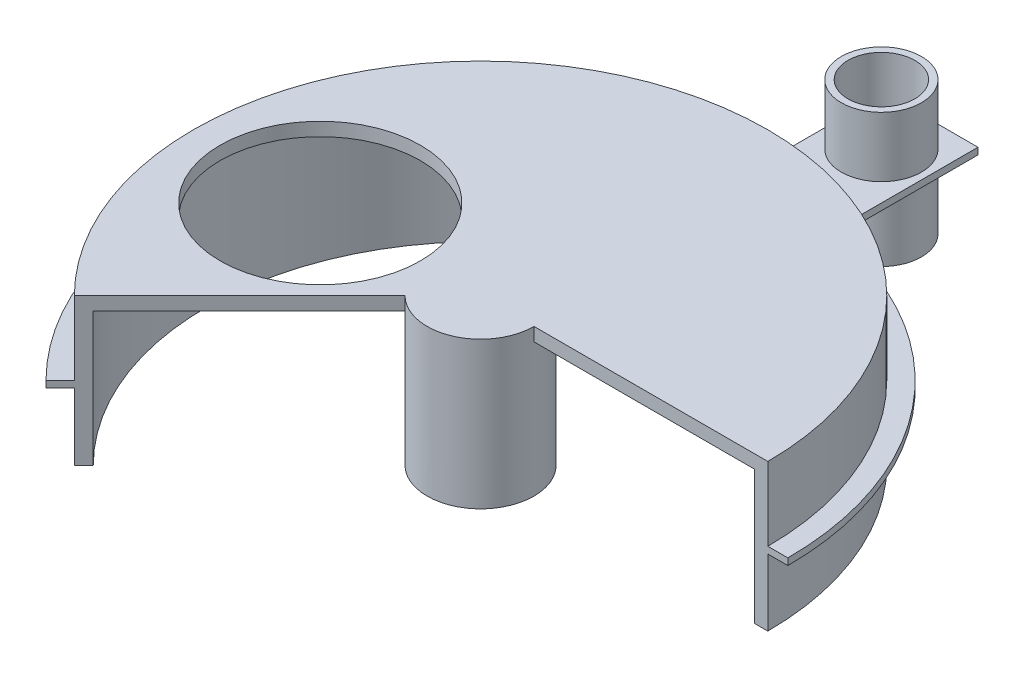
ISO-10303-21;
HEADER;
FILE_DESCRIPTION(('STEP AP214'),'2;1');
FILE_NAME('part.step','',(''),(''),'','','');
FILE_SCHEMA(('AUTOMOTIVE_DESIGN { 1 0 10303 214 1 1 1 1 }'));
ENDSEC;
DATA;
#1=APPLICATION_CONTEXT('core data for automotive mechanical design processes');
#2=APPLICATION_PROTOCOL_DEFINITION('international standard','automotive_design',2000,#1);
#3=PRODUCT_CONTEXT('',#1,'mechanical');
#4=PRODUCT('Part','Part','',(#3));
#5=PRODUCT_RELATED_PRODUCT_CATEGORY('part','',(#4));
#6=PRODUCT_DEFINITION_FORMATION('','',#4);
#7=PRODUCT_DEFINITION_CONTEXT('part definition',#1,'design');
#8=PRODUCT_DEFINITION('design','',#6,#7);
#9=PRODUCT_DEFINITION_SHAPE('','',#8);
#10=(LENGTH_UNIT() NAMED_UNIT(*) SI_UNIT(.MILLI.,.METRE.));
#11=(NAMED_UNIT(*) PLANE_ANGLE_UNIT() SI_UNIT($,.RADIAN.));
#12=(NAMED_UNIT(*) SI_UNIT($,.STERADIAN.) SOLID_ANGLE_UNIT());
#13=UNCERTAINTY_MEASURE_WITH_UNIT(LENGTH_MEASURE(1.E-05),#10,'distance_accuracy_value','');
#14=(GEOMETRIC_REPRESENTATION_CONTEXT(3) GLOBAL_UNCERTAINTY_ASSIGNED_CONTEXT((#13)) GLOBAL_UNIT_ASSIGNED_CONTEXT((#10,
#11,#12)) REPRESENTATION_CONTEXT('',''));
#15=CARTESIAN_POINT('',(0.,0.,0.));
#16=DIRECTION('',(0.,0.,1.));
#17=DIRECTION('',(1.,0.,0.));
#18=AXIS2_PLACEMENT_3D('',#15,#16,#17);
#19=CARTESIAN_POINT('',(0.,100.,-300.));
#20=DIRECTION('',(0.,1.,0.));
#21=DIRECTION('',(0.,0.,1.));
#22=AXIS2_PLACEMENT_3D('',#19,#20,#21);
#23=PLANE('',#22);
#24=CARTESIAN_POINT('',(0.,100.,-300.));
#25=DIRECTION('',(0.,1.,0.));
#26=DIRECTION('',(0.,0.,1.));
#27=AXIS2_PLACEMENT_3D('',#24,#25,#26);
#28=CIRCLE('',#27,30.);
#29=CARTESIAN_POINT('',(0.,100.,-270.));
#30=VERTEX_POINT('',#29);
#31=EDGE_CURVE('E107',#30,#30,#28,.T.);
#32=ORIENTED_EDGE('',*,*,#31,.T.);
#33=EDGE_LOOP('',(#32));
#34=FACE_BOUND('',#33,.T.);
#35=CARTESIAN_POINT('',(0.,100.,-300.));
#36=DIRECTION('',(0.,1.,0.));
#37=DIRECTION('',(0.,0.,1.));
#38=AXIS2_PLACEMENT_3D('',#35,#36,#37);
#39=CIRCLE('',#38,25.);
#40=CARTESIAN_POINT('',(0.,100.,-275.));
#41=VERTEX_POINT('',#40);
#42=EDGE_CURVE('E98',#41,#41,#39,.T.);
#43=ORIENTED_EDGE('',*,*,#42,.F.);
#44=EDGE_LOOP('',(#43));
#45=FACE_BOUND('',#44,.T.);
#46=ADVANCED_FACE('F94',(#34,#45),#23,.T.);
#47=CARTESIAN_POINT('',(0.,0.,-300.));
#48=DIRECTION('',(0.,1.,0.));
#49=DIRECTION('',(0.,0.,1.));
#50=AXIS2_PLACEMENT_3D('',#47,#48,#49);
#51=PLANE('',#50);
#52=CARTESIAN_POINT('',(0.,0.,-300.));
#53=DIRECTION('',(0.,1.,0.));
#54=DIRECTION('',(0.,0.,1.));
#55=AXIS2_PLACEMENT_3D('',#52,#53,#54);
#56=CIRCLE('',#55,30.);
#57=CARTESIAN_POINT('',(0.,0.,-270.));
#58=VERTEX_POINT('',#57);
#59=EDGE_CURVE('E105',#58,#58,#56,.T.);
#60=ORIENTED_EDGE('',*,*,#59,.F.);
#61=EDGE_LOOP('',(#60));
#62=FACE_BOUND('',#61,.T.);
#63=CARTESIAN_POINT('',(0.,0.,-300.));
#64=DIRECTION('',(0.,1.,0.));
#65=DIRECTION('',(0.,0.,1.));
#66=AXIS2_PLACEMENT_3D('',#63,#64,#65);
#67=CIRCLE('',#66,25.);
#68=CARTESIAN_POINT('',(0.,0.,-275.));
#69=VERTEX_POINT('',#68);
#70=EDGE_CURVE('E12',#69,#69,#67,.T.);
#71=ORIENTED_EDGE('',*,*,#70,.T.);
#72=EDGE_LOOP('',(#71));
#73=FACE_BOUND('',#72,.T.);
#74=ADVANCED_FACE('F115',(#62,#73),#51,.F.);
#75=CARTESIAN_POINT('',(0.,100.,-300.));
#76=DIRECTION('',(0.,-1.,0.));
#77=DIRECTION('',(0.,0.,-1.));
#78=AXIS2_PLACEMENT_3D('',#75,#76,#77);
#79=CYLINDRICAL_SURFACE('',#78,30.);
#80=ORIENTED_EDGE('',*,*,#31,.F.);
#81=EDGE_LOOP('',(#80));
#82=FACE_BOUND('',#81,.T.);
#83=ORIENTED_EDGE('',*,*,#59,.T.);
#84=EDGE_LOOP('',(#83));
#85=FACE_BOUND('',#84,.T.);
#86=ADVANCED_FACE('F113',(#82,#85),#79,.T.);
#87=CARTESIAN_POINT('',(0.,100.,-300.));
#88=DIRECTION('',(0.,-1.,0.));
#89=DIRECTION('',(0.,0.,-1.));
#90=AXIS2_PLACEMENT_3D('',#87,#88,#89);
#91=CYLINDRICAL_SURFACE('',#90,25.);
#92=ORIENTED_EDGE('',*,*,#42,.T.);
#93=EDGE_LOOP('',(#92));
#94=FACE_BOUND('',#93,.T.);
#95=ORIENTED_EDGE('',*,*,#70,.F.);
#96=EDGE_LOOP('',(#95));
#97=FACE_BOUND('',#96,.T.);
#98=ADVANCED_FACE('F96',(#94,#97),#91,.F.);
#99=CLOSED_SHELL('',(#46,#74,#86,#98));
#100=MANIFOLD_SOLID_BREP('B2',#99);
#101=CARTESIAN_POINT('',(0.,110.,0.));
#102=DIRECTION('',(0.,0.,-1.));
#103=DIRECTION('',(-1.,0.,0.));
#104=AXIS2_PLACEMENT_3D('',#101,#102,#103);
#105=PLANE('',#104);
#106=DIRECTION('',(0.,-1.,0.));
#107=VECTOR('',#106,1.);
#108=CARTESIAN_POINT('',(40.,110.,0.));
#109=LINE('',#108,#107);
#110=CARTESIAN_POINT('',(40.,110.,0.));
#111=VERTEX_POINT('',#110);
#112=CARTESIAN_POINT('',(40.,100.,0.));
#113=VERTEX_POINT('',#112);
#114=EDGE_CURVE('E271',#111,#113,#109,.T.);
#115=ORIENTED_EDGE('',*,*,#114,.T.);
#116=DIRECTION('',(1.,0.,0.));
#117=VECTOR('',#116,1.);
#118=CARTESIAN_POINT('',(0.,100.,0.));
#119=LINE('',#118,#117);
#120=CARTESIAN_POINT('',(205.,100.,0.));
#121=VERTEX_POINT('',#120);
#122=EDGE_CURVE('E297',#113,#121,#119,.T.);
#123=ORIENTED_EDGE('',*,*,#122,.T.);
#124=DIRECTION('',(0.,-1.,0.));
#125=VECTOR('',#124,1.);
#126=CARTESIAN_POINT('',(205.,100.,0.));
#127=LINE('',#126,#125);
#128=CARTESIAN_POINT('',(205.,0.,0.));
#129=VERTEX_POINT('',#128);
#130=EDGE_CURVE('E427',#121,#129,#127,.T.);
#131=ORIENTED_EDGE('',*,*,#130,.T.);
#132=DIRECTION('',(1.,0.,0.));
#133=VECTOR('',#132,1.);
#134=CARTESIAN_POINT('',(215.,0.,0.));
#135=LINE('',#134,#133);
#136=CARTESIAN_POINT('',(215.,0.,0.));
#137=VERTEX_POINT('',#136);
#138=EDGE_CURVE('E431',#129,#137,#135,.T.);
#139=ORIENTED_EDGE('',*,*,#138,.T.);
#140=DIRECTION('',(0.,-1.,0.));
#141=VECTOR('',#140,1.);
#142=CARTESIAN_POINT('',(215.,110.,0.));
#143=LINE('',#142,#141);
#144=CARTESIAN_POINT('',(215.,50.,0.));
#145=VERTEX_POINT('',#144);
#146=EDGE_CURVE('E304',#145,#137,#143,.T.);
#147=ORIENTED_EDGE('',*,*,#146,.F.);
#148=DIRECTION('',(1.,0.,0.));
#149=VECTOR('',#148,1.);
#150=CARTESIAN_POINT('',(0.,50.,0.));
#151=LINE('',#150,#149);
#152=CARTESIAN_POINT('',(230.,50.,0.));
#153=VERTEX_POINT('',#152);
#154=EDGE_CURVE('E393',#145,#153,#151,.T.);
#155=ORIENTED_EDGE('',*,*,#154,.T.);
#156=DIRECTION('',(0.,-1.,0.));
#157=VECTOR('',#156,1.);
#158=CARTESIAN_POINT('',(230.,55.,0.));
#159=LINE('',#158,#157);
#160=CARTESIAN_POINT('',(230.,55.,0.));
#161=VERTEX_POINT('',#160);
#162=EDGE_CURVE('E391',#161,#153,#159,.T.);
#163=ORIENTED_EDGE('',*,*,#162,.F.);
#164=DIRECTION('',(1.,0.,0.));
#165=VECTOR('',#164,1.);
#166=CARTESIAN_POINT('',(0.,55.,0.));
#167=LINE('',#166,#165);
#168=CARTESIAN_POINT('',(215.,55.,0.));
#169=VERTEX_POINT('',#168);
#170=EDGE_CURVE('E382',#169,#161,#167,.T.);
#171=ORIENTED_EDGE('',*,*,#170,.F.);
#172=CARTESIAN_POINT('',(215.,110.,0.));
#173=VERTEX_POINT('',#172);
#174=EDGE_CURVE('E280',#173,#169,#143,.T.);
#175=ORIENTED_EDGE('',*,*,#174,.F.);
#176=DIRECTION('',(1.,0.,0.));
#177=VECTOR('',#176,1.);
#178=CARTESIAN_POINT('',(0.,110.,0.));
#179=LINE('',#178,#177);
#180=EDGE_CURVE('E262',#111,#173,#179,.T.);
#181=ORIENTED_EDGE('',*,*,#180,.F.);
#182=EDGE_LOOP('',(#115,#123,#131,#139,#147,#155,#163,#171,#175,#181));
#183=FACE_BOUND('',#182,.T.);
#184=ADVANCED_FACE('F155',(#183),#105,.F.);
#185=CARTESIAN_POINT('',(5.88784672006415E-13,110.,5.88784672006417E-13));
#186=DIRECTION('',(-0.707106781186546,0.,-0.707106781186549));
#187=DIRECTION('',(-0.707106781186549,0.,0.707106781186546));
#188=AXIS2_PLACEMENT_3D('',#185,#186,#187);
#189=PLANE('',#188);
#190=DIRECTION('',(0.,-1.,0.));
#191=VECTOR('',#190,1.);
#192=CARTESIAN_POINT('',(-28.2842712474614,110.,28.2842712474624));
#193=LINE('',#192,#191);
#194=CARTESIAN_POINT('',(-28.2842712474614,110.,28.2842712474624));
#195=VERTEX_POINT('',#194);
#196=CARTESIAN_POINT('',(-28.2842712474614,100.,28.2842712474624));
#197=VERTEX_POINT('',#196);
#198=EDGE_CURVE('E268',#195,#197,#193,.T.);
#199=ORIENTED_EDGE('',*,*,#198,.F.);
#200=DIRECTION('',(0.707106781186549,0.,-0.707106781186546));
#201=VECTOR('',#200,1.);
#202=CARTESIAN_POINT('',(5.88784672006415E-13,110.,5.88784672006417E-13));
#203=LINE('',#202,#201);
#204=CARTESIAN_POINT('',(-152.027957955107,110.,152.027957955108));
#205=VERTEX_POINT('',#204);
#206=EDGE_CURVE('E265',#205,#195,#203,.T.);
#207=ORIENTED_EDGE('',*,*,#206,.F.);
#208=DIRECTION('',(0.,-1.,0.));
#209=VECTOR('',#208,1.);
#210=CARTESIAN_POINT('',(-152.027957955107,110.,152.027957955108));
#211=LINE('',#210,#209);
#212=CARTESIAN_POINT('',(-152.027957955107,55.,152.027957955108));
#213=VERTEX_POINT('',#212);
#214=EDGE_CURVE('E301',#205,#213,#211,.T.);
#215=ORIENTED_EDGE('',*,*,#214,.T.);
#216=DIRECTION('',(-0.707106781186546,0.,0.707106781186549));
#217=VECTOR('',#216,1.);
#218=CARTESIAN_POINT('',(0.,55.,0.));
#219=LINE('',#218,#217);
#220=CARTESIAN_POINT('',(-162.634559672906,55.,162.634559672906));
#221=VERTEX_POINT('',#220);
#222=EDGE_CURVE('E473',#213,#221,#219,.T.);
#223=ORIENTED_EDGE('',*,*,#222,.T.);
#224=DIRECTION('',(0.,-1.,0.));
#225=VECTOR('',#224,1.);
#226=CARTESIAN_POINT('',(-162.634559672906,55.,162.634559672906));
#227=LINE('',#226,#225);
#228=CARTESIAN_POINT('',(-162.634559672906,50.,162.634559672906));
#229=VERTEX_POINT('',#228);
#230=EDGE_CURVE('E460',#221,#229,#227,.T.);
#231=ORIENTED_EDGE('',*,*,#230,.T.);
#232=DIRECTION('',(-0.707106781186546,0.,0.707106781186549));
#233=VECTOR('',#232,1.);
#234=CARTESIAN_POINT('',(0.,50.,0.));
#235=LINE('',#234,#233);
#236=CARTESIAN_POINT('',(-152.027957955107,50.,152.027957955108));
#237=VERTEX_POINT('',#236);
#238=EDGE_CURVE('E453',#237,#229,#235,.T.);
#239=ORIENTED_EDGE('',*,*,#238,.F.);
#240=CARTESIAN_POINT('',(-152.027957955107,0.,152.027957955108));
#241=VERTEX_POINT('',#240);
#242=EDGE_CURVE('E296',#237,#241,#211,.T.);
#243=ORIENTED_EDGE('',*,*,#242,.T.);
#244=DIRECTION('',(0.707106781186549,0.,-0.707106781186546));
#245=VECTOR('',#244,1.);
#246=CARTESIAN_POINT('',(-144.956890143242,0.,144.956890143243));
#247=LINE('',#246,#245);
#248=CARTESIAN_POINT('',(-144.956890143242,0.,144.956890143243));
#249=VERTEX_POINT('',#248);
#250=EDGE_CURVE('E396',#241,#249,#247,.T.);
#251=ORIENTED_EDGE('',*,*,#250,.T.);
#252=DIRECTION('',(0.,-1.,0.));
#253=VECTOR('',#252,1.);
#254=CARTESIAN_POINT('',(-144.956890143242,100.,144.956890143243));
#255=LINE('',#254,#253);
#256=CARTESIAN_POINT('',(-144.956890143242,100.,144.956890143243));
#257=VERTEX_POINT('',#256);
#258=EDGE_CURVE('E289',#257,#249,#255,.T.);
#259=ORIENTED_EDGE('',*,*,#258,.F.);
#260=DIRECTION('',(0.707106781186549,0.,-0.707106781186546));
#261=VECTOR('',#260,1.);
#262=CARTESIAN_POINT('',(5.88784672006415E-13,100.,5.88784672006417E-13));
#263=LINE('',#262,#261);
#264=EDGE_CURVE('E286',#257,#197,#263,.T.);
#265=ORIENTED_EDGE('',*,*,#264,.T.);
#266=EDGE_LOOP('',(#199,#207,#215,#223,#231,#239,#243,#251,#259,#265));
#267=FACE_BOUND('',#266,.T.);
#268=ADVANCED_FACE('F334',(#267),#189,.F.);
#269=CARTESIAN_POINT('',(0.,110.,0.));
#270=DIRECTION('',(0.,-1.,0.));
#271=DIRECTION('',(0.,0.,-1.));
#272=AXIS2_PLACEMENT_3D('',#269,#270,#271);
#273=CYLINDRICAL_SURFACE('',#272,215.);
#274=CARTESIAN_POINT('',(0.,50.,0.));
#275=DIRECTION('',(0.,1.,0.));
#276=DIRECTION('',(0.,0.,1.));
#277=AXIS2_PLACEMENT_3D('',#274,#275,#276);
#278=CIRCLE('',#277,215.);
#279=EDGE_CURVE('E170',#145,#237,#278,.T.);
#280=ORIENTED_EDGE('',*,*,#279,.F.);
#281=ORIENTED_EDGE('',*,*,#146,.T.);
#282=CARTESIAN_POINT('',(0.,0.,0.));
#283=DIRECTION('',(0.,1.,0.));
#284=DIRECTION('',(0.,0.,-1.));
#285=AXIS2_PLACEMENT_3D('',#282,#283,#284);
#286=CIRCLE('',#285,215.);
#287=EDGE_CURVE('E428',#137,#241,#286,.T.);
#288=ORIENTED_EDGE('',*,*,#287,.T.);
#289=ORIENTED_EDGE('',*,*,#242,.F.);
#290=EDGE_LOOP('',(#280,#281,#288,#289));
#291=FACE_BOUND('',#290,.T.);
#292=ADVANCED_FACE('F339',(#291),#273,.T.);
#293=CARTESIAN_POINT('',(0.,100.,0.));
#294=DIRECTION('',(0.,1.,0.));
#295=DIRECTION('',(0.,0.,1.));
#296=AXIS2_PLACEMENT_3D('',#293,#294,#295);
#297=PLANE('',#296);
#298=CARTESIAN_POINT('',(-120.,100.,0.));
#299=DIRECTION('',(0.,1.,0.));
#300=DIRECTION('',(0.,0.,1.));
#301=AXIS2_PLACEMENT_3D('',#298,#299,#300);
#302=CIRCLE('',#301,75.);
#303=CARTESIAN_POINT('',(-120.,100.,75.));
#304=VERTEX_POINT('',#303);
#305=EDGE_CURVE('E282',#304,#304,#302,.T.);
#306=ORIENTED_EDGE('',*,*,#305,.T.);
#307=EDGE_LOOP('',(#306));
#308=FACE_BOUND('',#307,.T.);
#309=CARTESIAN_POINT('',(0.,100.,0.));
#310=DIRECTION('',(0.,-1.,0.));
#311=DIRECTION('',(0.,0.,1.));
#312=AXIS2_PLACEMENT_3D('',#309,#310,#311);
#313=CIRCLE('',#312,205.);
#314=EDGE_CURVE('E178',#257,#121,#313,.T.);
#315=ORIENTED_EDGE('',*,*,#314,.T.);
#316=ORIENTED_EDGE('',*,*,#122,.F.);
#317=CARTESIAN_POINT('',(0.,100.,0.));
#318=DIRECTION('',(0.,1.,0.));
#319=DIRECTION('',(0.,0.,1.));
#320=AXIS2_PLACEMENT_3D('',#317,#318,#319);
#321=CIRCLE('',#320,40.);
#322=EDGE_CURVE('E92',#113,#197,#321,.T.);
#323=ORIENTED_EDGE('',*,*,#322,.T.);
#324=ORIENTED_EDGE('',*,*,#264,.F.);
#325=EDGE_LOOP('',(#315,#316,#323,#324));
#326=FACE_BOUND('',#325,.T.);
#327=ADVANCED_FACE('F332',(#308,#326),#297,.F.);
#328=CARTESIAN_POINT('',(0.,0.,0.));
#329=DIRECTION('',(0.,1.,0.));
#330=DIRECTION('',(0.,0.,1.));
#331=AXIS2_PLACEMENT_3D('',#328,#329,#330);
#332=PLANE('',#331);
#333=CARTESIAN_POINT('',(0.,0.,0.));
#334=DIRECTION('',(0.,1.,0.));
#335=DIRECTION('',(0.,0.,1.));
#336=AXIS2_PLACEMENT_3D('',#333,#334,#335);
#337=CIRCLE('',#336,40.);
#338=CARTESIAN_POINT('',(0.,0.,40.));
#339=VERTEX_POINT('',#338);
#340=EDGE_CURVE('E159',#339,#339,#337,.T.);
#341=ORIENTED_EDGE('',*,*,#340,.F.);
#342=EDGE_LOOP('',(#341));
#343=FACE_BOUND('',#342,.T.);
#344=CARTESIAN_POINT('',(0.,0.,0.));
#345=DIRECTION('',(0.,1.,0.));
#346=DIRECTION('',(0.,0.,1.));
#347=AXIS2_PLACEMENT_3D('',#344,#345,#346);
#348=CIRCLE('',#347,35.);
#349=CARTESIAN_POINT('',(0.,0.,35.));
#350=VERTEX_POINT('',#349);
#351=EDGE_CURVE('E306',#350,#350,#348,.T.);
#352=ORIENTED_EDGE('',*,*,#351,.T.);
#353=EDGE_LOOP('',(#352));
#354=FACE_BOUND('',#353,.T.);
#355=ADVANCED_FACE('F313',(#343,#354),#332,.F.);
#356=CARTESIAN_POINT('',(0.,100.,0.));
#357=DIRECTION('',(0.,-1.,0.));
#358=DIRECTION('',(0.,0.,-1.));
#359=AXIS2_PLACEMENT_3D('',#356,#357,#358);
#360=CYLINDRICAL_SURFACE('',#359,40.);
#361=ORIENTED_EDGE('',*,*,#322,.F.);
#362=ORIENTED_EDGE('',*,*,#114,.F.);
#363=CARTESIAN_POINT('',(0.,110.,0.));
#364=DIRECTION('',(0.,1.,0.));
#365=DIRECTION('',(0.,0.,1.));
#366=AXIS2_PLACEMENT_3D('',#363,#364,#365);
#367=CIRCLE('',#366,40.);
#368=EDGE_CURVE('E257',#195,#111,#367,.T.);
#369=ORIENTED_EDGE('',*,*,#368,.F.);
#370=ORIENTED_EDGE('',*,*,#198,.T.);
#371=EDGE_LOOP('',(#361,#362,#369,#370));
#372=FACE_BOUND('',#371,.T.);
#373=ORIENTED_EDGE('',*,*,#340,.T.);
#374=EDGE_LOOP('',(#373));
#375=FACE_BOUND('',#374,.T.);
#376=ADVANCED_FACE('F157',(#372,#375),#360,.T.);
#377=CARTESIAN_POINT('',(0.,100.,0.));
#378=DIRECTION('',(0.,-1.,0.));
#379=DIRECTION('',(0.,0.,-1.));
#380=AXIS2_PLACEMENT_3D('',#377,#378,#379);
#381=CYLINDRICAL_SURFACE('',#380,35.);
#382=CARTESIAN_POINT('',(0.,100.,0.));
#383=DIRECTION('',(0.,1.,0.));
#384=DIRECTION('',(0.,0.,1.));
#385=AXIS2_PLACEMENT_3D('',#382,#383,#384);
#386=CIRCLE('',#385,35.);
#387=CARTESIAN_POINT('',(0.,100.,35.));
#388=VERTEX_POINT('',#387);
#389=EDGE_CURVE('E307',#388,#388,#386,.T.);
#390=ORIENTED_EDGE('',*,*,#389,.T.);
#391=EDGE_LOOP('',(#390));
#392=FACE_BOUND('',#391,.T.);
#393=ORIENTED_EDGE('',*,*,#351,.F.);
#394=EDGE_LOOP('',(#393));
#395=FACE_BOUND('',#394,.T.);
#396=ADVANCED_FACE('F315',(#392,#395),#381,.F.);
#397=CARTESIAN_POINT('',(-120.,110.,0.));
#398=DIRECTION('',(0.,-1.,0.));
#399=DIRECTION('',(0.,0.,-1.));
#400=AXIS2_PLACEMENT_3D('',#397,#398,#399);
#401=CYLINDRICAL_SURFACE('',#400,75.);
#402=CARTESIAN_POINT('',(-120.,110.,0.));
#403=DIRECTION('',(0.,1.,0.));
#404=DIRECTION('',(0.,0.,1.));
#405=AXIS2_PLACEMENT_3D('',#402,#403,#404);
#406=CIRCLE('',#405,75.);
#407=CARTESIAN_POINT('',(-120.,110.,75.));
#408=VERTEX_POINT('',#407);
#409=EDGE_CURVE('E293',#408,#408,#406,.T.);
#410=ORIENTED_EDGE('',*,*,#409,.T.);
#411=EDGE_LOOP('',(#410));
#412=FACE_BOUND('',#411,.T.);
#413=ORIENTED_EDGE('',*,*,#305,.F.);
#414=EDGE_LOOP('',(#413));
#415=FACE_BOUND('',#414,.T.);
#416=ADVANCED_FACE('F317',(#412,#415),#401,.F.);
#417=ORIENTED_EDGE('',*,*,#389,.F.);
#418=EDGE_LOOP('',(#417));
#419=FACE_BOUND('',#418,.T.);
#420=ADVANCED_FACE('F320',(#419),#297,.F.);
#421=ORIENTED_EDGE('',*,*,#174,.T.);
#422=CARTESIAN_POINT('',(0.,55.,0.));
#423=DIRECTION('',(0.,1.,0.));
#424=DIRECTION('',(0.,0.,1.));
#425=AXIS2_PLACEMENT_3D('',#422,#423,#424);
#426=CIRCLE('',#425,215.);
#427=EDGE_CURVE('E387',#169,#213,#426,.T.);
#428=ORIENTED_EDGE('',*,*,#427,.T.);
#429=ORIENTED_EDGE('',*,*,#214,.F.);
#430=CARTESIAN_POINT('',(0.,110.,0.));
#431=DIRECTION('',(0.,1.,0.));
#432=DIRECTION('',(0.,0.,1.));
#433=AXIS2_PLACEMENT_3D('',#430,#431,#432);
#434=CIRCLE('',#433,215.);
#435=EDGE_CURVE('E281',#173,#205,#434,.T.);
#436=ORIENTED_EDGE('',*,*,#435,.F.);
#437=EDGE_LOOP('',(#421,#428,#429,#436));
#438=FACE_BOUND('',#437,.T.);
#439=ADVANCED_FACE('F328',(#438),#273,.T.);
#440=CARTESIAN_POINT('',(0.,110.,0.));
#441=DIRECTION('',(0.,1.,0.));
#442=DIRECTION('',(0.,0.,1.));
#443=AXIS2_PLACEMENT_3D('',#440,#441,#442);
#444=PLANE('',#443);
#445=ORIENTED_EDGE('',*,*,#368,.T.);
#446=ORIENTED_EDGE('',*,*,#180,.T.);
#447=ORIENTED_EDGE('',*,*,#435,.T.);
#448=ORIENTED_EDGE('',*,*,#206,.T.);
#449=EDGE_LOOP('',(#445,#446,#447,#448));
#450=FACE_BOUND('',#449,.T.);
#451=ORIENTED_EDGE('',*,*,#409,.F.);
#452=EDGE_LOOP('',(#451));
#453=FACE_BOUND('',#452,.T.);
#454=ADVANCED_FACE('F259',(#450,#453),#444,.T.);
#455=CARTESIAN_POINT('',(0.,100.,0.));
#456=DIRECTION('',(0.,-1.,0.));
#457=DIRECTION('',(0.,0.,-1.));
#458=AXIS2_PLACEMENT_3D('',#455,#456,#457);
#459=CYLINDRICAL_SURFACE('',#458,205.);
#460=CARTESIAN_POINT('',(0.,0.,0.));
#461=DIRECTION('',(0.,-1.,0.));
#462=DIRECTION('',(0.,0.,1.));
#463=AXIS2_PLACEMENT_3D('',#460,#461,#462);
#464=CIRCLE('',#463,205.);
#465=EDGE_CURVE('E400',#249,#129,#464,.T.);
#466=ORIENTED_EDGE('',*,*,#465,.T.);
#467=ORIENTED_EDGE('',*,*,#130,.F.);
#468=ORIENTED_EDGE('',*,*,#314,.F.);
#469=ORIENTED_EDGE('',*,*,#258,.T.);
#470=EDGE_LOOP('',(#466,#467,#468,#469));
#471=FACE_BOUND('',#470,.T.);
#472=ADVANCED_FACE('F348',(#471),#459,.F.);
#473=CARTESIAN_POINT('',(0.,0.,0.));
#474=DIRECTION('',(0.,1.,0.));
#475=DIRECTION('',(0.,0.,1.));
#476=AXIS2_PLACEMENT_3D('',#473,#474,#475);
#477=PLANE('',#476);
#478=ORIENTED_EDGE('',*,*,#250,.F.);
#479=ORIENTED_EDGE('',*,*,#287,.F.);
#480=ORIENTED_EDGE('',*,*,#138,.F.);
#481=ORIENTED_EDGE('',*,*,#465,.F.);
#482=EDGE_LOOP('',(#478,#479,#480,#481));
#483=FACE_BOUND('',#482,.T.);
#484=ADVANCED_FACE('F351',(#483),#477,.F.);
#485=CARTESIAN_POINT('',(0.,55.,0.));
#486=DIRECTION('',(0.,-1.,0.));
#487=DIRECTION('',(0.,0.,-1.));
#488=AXIS2_PLACEMENT_3D('',#485,#486,#487);
#489=CYLINDRICAL_SURFACE('',#488,230.);
#490=CARTESIAN_POINT('',(0.,50.,0.));
#491=DIRECTION('',(0.,1.,0.));
#492=DIRECTION('',(0.,0.,1.));
#493=AXIS2_PLACEMENT_3D('',#490,#491,#492);
#494=CIRCLE('',#493,230.);
#495=CARTESIAN_POINT('',(35.,50.,-227.321358433386));
#496=VERTEX_POINT('',#495);
#497=EDGE_CURVE('E469',#153,#496,#494,.T.);
#498=ORIENTED_EDGE('',*,*,#497,.T.);
#499=DIRECTION('',(0.,-1.,0.));
#500=VECTOR('',#499,1.);
#501=CARTESIAN_POINT('',(35.,55.,-227.321358433386));
#502=LINE('',#501,#500);
#503=CARTESIAN_POINT('',(35.,55.,-227.321358433386));
#504=VERTEX_POINT('',#503);
#505=EDGE_CURVE('E397',#504,#496,#502,.T.);
#506=ORIENTED_EDGE('',*,*,#505,.F.);
#507=CARTESIAN_POINT('',(0.,55.,0.));
#508=DIRECTION('',(0.,1.,0.));
#509=DIRECTION('',(0.,0.,1.));
#510=AXIS2_PLACEMENT_3D('',#507,#508,#509);
#511=CIRCLE('',#510,230.);
#512=EDGE_CURVE('E385',#161,#504,#511,.T.);
#513=ORIENTED_EDGE('',*,*,#512,.F.);
#514=ORIENTED_EDGE('',*,*,#162,.T.);
#515=EDGE_LOOP('',(#498,#506,#513,#514));
#516=FACE_BOUND('',#515,.T.);
#517=ADVANCED_FACE('F354',(#516),#489,.T.);
#518=CARTESIAN_POINT('',(-35.,50.,-227.321358433386));
#519=VERTEX_POINT('',#518);
#520=EDGE_CURVE('E456',#519,#229,#494,.T.);
#521=ORIENTED_EDGE('',*,*,#520,.T.);
#522=ORIENTED_EDGE('',*,*,#230,.F.);
#523=CARTESIAN_POINT('',(-35.,55.,-227.321358433386));
#524=VERTEX_POINT('',#523);
#525=EDGE_CURVE('E466',#524,#221,#511,.T.);
#526=ORIENTED_EDGE('',*,*,#525,.F.);
#527=DIRECTION('',(0.,-1.,0.));
#528=VECTOR('',#527,1.);
#529=CARTESIAN_POINT('',(-35.,55.,-227.321358433386));
#530=LINE('',#529,#528);
#531=EDGE_CURVE('E402',#524,#519,#530,.T.);
#532=ORIENTED_EDGE('',*,*,#531,.T.);
#533=EDGE_LOOP('',(#521,#522,#526,#532));
#534=FACE_BOUND('',#533,.T.);
#535=ADVANCED_FACE('F368',(#534),#489,.T.);
#536=CARTESIAN_POINT('',(0.,55.,0.));
#537=DIRECTION('',(0.,1.,0.));
#538=DIRECTION('',(0.,0.,1.));
#539=AXIS2_PLACEMENT_3D('',#536,#537,#538);
#540=PLANE('',#539);
#541=ORIENTED_EDGE('',*,*,#170,.T.);
#542=ORIENTED_EDGE('',*,*,#512,.T.);
#543=DIRECTION('',(0.,0.,1.));
#544=VECTOR('',#543,1.);
#545=CARTESIAN_POINT('',(35.,55.,-337.321358433386));
#546=LINE('',#545,#544);
#547=CARTESIAN_POINT('',(35.,55.,-337.321358433386));
#548=VERTEX_POINT('',#547);
#549=EDGE_CURVE('E413',#548,#504,#546,.T.);
#550=ORIENTED_EDGE('',*,*,#549,.F.);
#551=DIRECTION('',(1.,0.,0.));
#552=VECTOR('',#551,1.);
#553=CARTESIAN_POINT('',(-35.,55.,-337.321358433386));
#554=LINE('',#553,#552);
#555=CARTESIAN_POINT('',(-35.,55.,-337.321358433386));
#556=VERTEX_POINT('',#555);
#557=EDGE_CURVE('E409',#556,#548,#554,.T.);
#558=ORIENTED_EDGE('',*,*,#557,.F.);
#559=DIRECTION('',(0.,0.,-1.));
#560=VECTOR('',#559,1.);
#561=CARTESIAN_POINT('',(-35.,55.,-227.321358433386));
#562=LINE('',#561,#560);
#563=EDGE_CURVE('E406',#524,#556,#562,.T.);
#564=ORIENTED_EDGE('',*,*,#563,.F.);
#565=ORIENTED_EDGE('',*,*,#525,.T.);
#566=ORIENTED_EDGE('',*,*,#222,.F.);
#567=ORIENTED_EDGE('',*,*,#427,.F.);
#568=EDGE_LOOP('',(#541,#542,#550,#558,#564,#565,#566,#567));
#569=FACE_BOUND('',#568,.T.);
#570=ADVANCED_FACE('F371',(#569),#540,.T.);
#571=CARTESIAN_POINT('',(0.,50.,0.));
#572=DIRECTION('',(0.,1.,0.));
#573=DIRECTION('',(0.,0.,1.));
#574=AXIS2_PLACEMENT_3D('',#571,#572,#573);
#575=PLANE('',#574);
#576=ORIENTED_EDGE('',*,*,#154,.F.);
#577=ORIENTED_EDGE('',*,*,#279,.T.);
#578=ORIENTED_EDGE('',*,*,#238,.T.);
#579=ORIENTED_EDGE('',*,*,#520,.F.);
#580=DIRECTION('',(0.,0.,-1.));
#581=VECTOR('',#580,1.);
#582=CARTESIAN_POINT('',(-35.,50.,-227.321358433386));
#583=LINE('',#582,#581);
#584=CARTESIAN_POINT('',(-35.,50.,-337.321358433386));
#585=VERTEX_POINT('',#584);
#586=EDGE_CURVE('E276',#519,#585,#583,.T.);
#587=ORIENTED_EDGE('',*,*,#586,.T.);
#588=DIRECTION('',(1.,0.,0.));
#589=VECTOR('',#588,1.);
#590=CARTESIAN_POINT('',(-35.,50.,-337.321358433386));
#591=LINE('',#590,#589);
#592=CARTESIAN_POINT('',(35.,50.,-337.321358433386));
#593=VERTEX_POINT('',#592);
#594=EDGE_CURVE('E419',#585,#593,#591,.T.);
#595=ORIENTED_EDGE('',*,*,#594,.T.);
#596=DIRECTION('',(0.,0.,1.));
#597=VECTOR('',#596,1.);
#598=CARTESIAN_POINT('',(35.,50.,-337.321358433386));
#599=LINE('',#598,#597);
#600=EDGE_CURVE('E410',#593,#496,#599,.T.);
#601=ORIENTED_EDGE('',*,*,#600,.T.);
#602=ORIENTED_EDGE('',*,*,#497,.F.);
#603=EDGE_LOOP('',(#576,#577,#578,#579,#587,#595,#601,#602));
#604=FACE_BOUND('',#603,.T.);
#605=ADVANCED_FACE('F361',(#604),#575,.F.);
#606=CARTESIAN_POINT('',(-35.,55.,-227.321358433386));
#607=DIRECTION('',(-1.,0.,0.));
#608=DIRECTION('',(0.,0.,1.));
#609=AXIS2_PLACEMENT_3D('',#606,#607,#608);
#610=PLANE('',#609);
#611=ORIENTED_EDGE('',*,*,#586,.F.);
#612=ORIENTED_EDGE('',*,*,#531,.F.);
#613=ORIENTED_EDGE('',*,*,#563,.T.);
#614=DIRECTION('',(0.,-1.,0.));
#615=VECTOR('',#614,1.);
#616=CARTESIAN_POINT('',(-35.,55.,-337.321358433386));
#617=LINE('',#616,#615);
#618=EDGE_CURVE('E416',#556,#585,#617,.T.);
#619=ORIENTED_EDGE('',*,*,#618,.T.);
#620=EDGE_LOOP('',(#611,#612,#613,#619));
#621=FACE_BOUND('',#620,.T.);
#622=ADVANCED_FACE('F357',(#621),#610,.T.);
#623=CARTESIAN_POINT('',(-35.,55.,-337.321358433386));
#624=DIRECTION('',(0.,0.,-1.));
#625=DIRECTION('',(-1.,0.,0.));
#626=AXIS2_PLACEMENT_3D('',#623,#624,#625);
#627=PLANE('',#626);
#628=ORIENTED_EDGE('',*,*,#594,.F.);
#629=ORIENTED_EDGE('',*,*,#618,.F.);
#630=ORIENTED_EDGE('',*,*,#557,.T.);
#631=DIRECTION('',(0.,-1.,0.));
#632=VECTOR('',#631,1.);
#633=CARTESIAN_POINT('',(35.,55.,-337.321358433386));
#634=LINE('',#633,#632);
#635=EDGE_CURVE('E424',#548,#593,#634,.T.);
#636=ORIENTED_EDGE('',*,*,#635,.T.);
#637=EDGE_LOOP('',(#628,#629,#630,#636));
#638=FACE_BOUND('',#637,.T.);
#639=ADVANCED_FACE('F360',(#638),#627,.T.);
#640=CARTESIAN_POINT('',(35.,55.,-337.321358433386));
#641=DIRECTION('',(1.,0.,0.));
#642=DIRECTION('',(0.,0.,-1.));
#643=AXIS2_PLACEMENT_3D('',#640,#641,#642);
#644=PLANE('',#643);
#645=ORIENTED_EDGE('',*,*,#600,.F.);
#646=ORIENTED_EDGE('',*,*,#635,.F.);
#647=ORIENTED_EDGE('',*,*,#549,.T.);
#648=ORIENTED_EDGE('',*,*,#505,.T.);
#649=EDGE_LOOP('',(#645,#646,#647,#648));
#650=FACE_BOUND('',#649,.T.);
#651=ADVANCED_FACE('F356',(#650),#644,.T.);
#652=CLOSED_SHELL('',(#184,#268,#292,#327,#355,#376,#396,#416,#420,#439,#454,#472,#484,#517,
#535,#570,#605,#622,#639,#651));
#653=MANIFOLD_SOLID_BREP('B7',#652);
#654=ADVANCED_BREP_SHAPE_REPRESENTATION('',(#18,#100,#653),#14);
#655=SHAPE_DEFINITION_REPRESENTATION(#9,#654);
ENDSEC;
END-ISO-10303-21;
